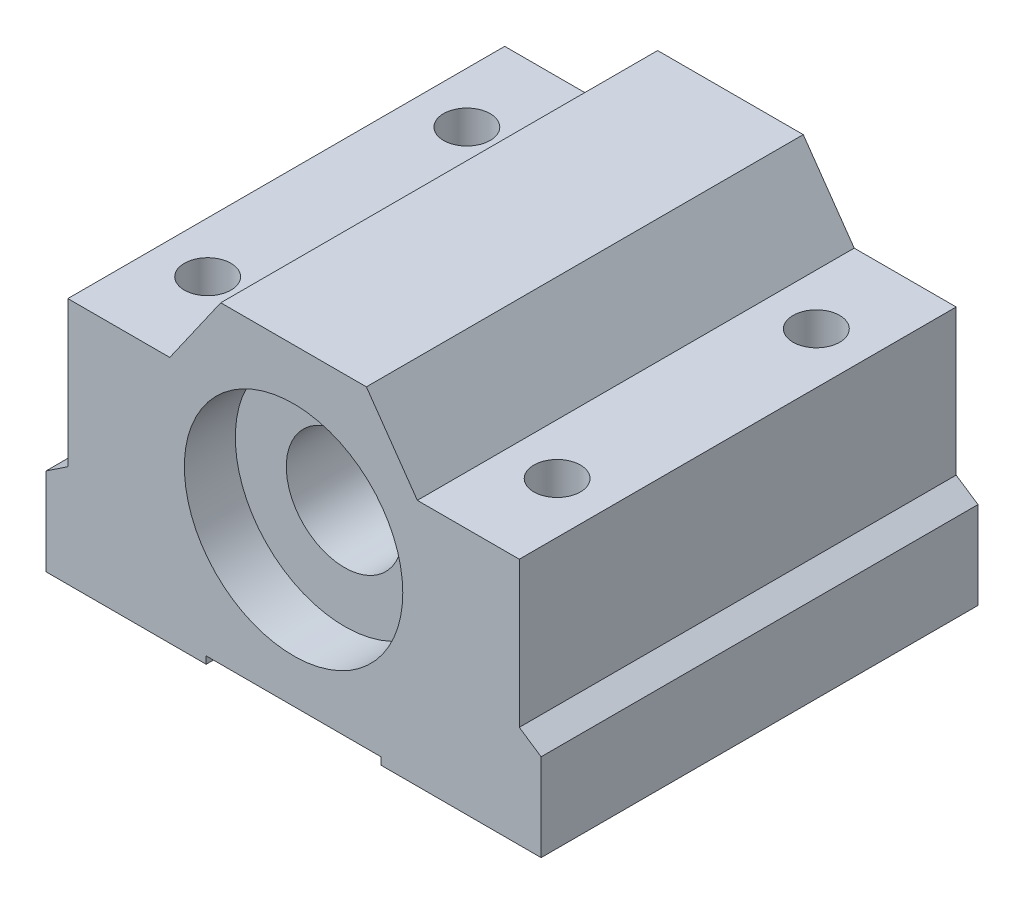
ISO-10303-21;
HEADER;
FILE_DESCRIPTION(('STEP AP214'),'2;1');
FILE_NAME('part.step','',(''),(''),'','','');
FILE_SCHEMA(('AUTOMOTIVE_DESIGN { 1 0 10303 214 1 1 1 1 }'));
ENDSEC;
DATA;
#1=APPLICATION_CONTEXT('core data for automotive mechanical design processes');
#2=APPLICATION_PROTOCOL_DEFINITION('international standard','automotive_design',2000,#1);
#3=PRODUCT_CONTEXT('',#1,'mechanical');
#4=PRODUCT('Part','Part','',(#3));
#5=PRODUCT_RELATED_PRODUCT_CATEGORY('part','',(#4));
#6=PRODUCT_DEFINITION_FORMATION('','',#4);
#7=PRODUCT_DEFINITION_CONTEXT('part definition',#1,'design');
#8=PRODUCT_DEFINITION('design','',#6,#7);
#9=PRODUCT_DEFINITION_SHAPE('','',#8);
#10=(LENGTH_UNIT() NAMED_UNIT(*) SI_UNIT(.MILLI.,.METRE.));
#11=(NAMED_UNIT(*) PLANE_ANGLE_UNIT() SI_UNIT($,.RADIAN.));
#12=(NAMED_UNIT(*) SI_UNIT($,.STERADIAN.) SOLID_ANGLE_UNIT());
#13=UNCERTAINTY_MEASURE_WITH_UNIT(LENGTH_MEASURE(1.E-05),#10,'distance_accuracy_value','');
#14=(GEOMETRIC_REPRESENTATION_CONTEXT(3) GLOBAL_UNCERTAINTY_ASSIGNED_CONTEXT((#13)) GLOBAL_UNIT_ASSIGNED_CONTEXT((#10,
#11,#12)) REPRESENTATION_CONTEXT('',''));
#15=CARTESIAN_POINT('',(0.,0.,0.));
#16=DIRECTION('',(0.,0.,1.));
#17=DIRECTION('',(1.,0.,0.));
#18=AXIS2_PLACEMENT_3D('',#15,#16,#17);
#19=CARTESIAN_POINT('',(0.,0.,-15.));
#20=DIRECTION('',(0.,0.,1.));
#21=DIRECTION('',(1.,0.,0.));
#22=AXIS2_PLACEMENT_3D('',#19,#20,#21);
#23=CYLINDRICAL_SURFACE('',#22,7.5);
#24=CARTESIAN_POINT('',(0.,0.,-15.));
#25=DIRECTION('',(0.,0.,1.));
#26=DIRECTION('',(1.,0.,0.));
#27=AXIS2_PLACEMENT_3D('',#24,#25,#26);
#28=CIRCLE('',#27,7.5);
#29=CARTESIAN_POINT('',(7.5,0.,-15.));
#30=VERTEX_POINT('',#29);
#31=EDGE_CURVE('E166',#30,#30,#28,.T.);
#32=ORIENTED_EDGE('',*,*,#31,.F.);
#33=EDGE_LOOP('',(#32));
#34=FACE_BOUND('',#33,.T.);
#35=CARTESIAN_POINT('',(0.,0.,-11.5));
#36=DIRECTION('',(0.,0.,1.));
#37=DIRECTION('',(1.,0.,0.));
#38=AXIS2_PLACEMENT_3D('',#35,#36,#37);
#39=CIRCLE('',#38,7.5);
#40=CARTESIAN_POINT('',(7.5,0.,-11.5));
#41=VERTEX_POINT('',#40);
#42=EDGE_CURVE('E11',#41,#41,#39,.F.);
#43=ORIENTED_EDGE('',*,*,#42,.F.);
#44=EDGE_LOOP('',(#43));
#45=FACE_BOUND('',#44,.T.);
#46=ADVANCED_FACE('F33',(#34,#45),#23,.F.);
#47=CARTESIAN_POINT('',(5.99999999999999,-11.,-15.));
#48=DIRECTION('',(0.,-1.,0.));
#49=DIRECTION('',(1.,0.,0.));
#50=AXIS2_PLACEMENT_3D('',#47,#48,#49);
#51=PLANE('',#50);
#52=CARTESIAN_POINT('',(12.,-11.,-8.9));
#53=DIRECTION('',(0.,1.,0.));
#54=DIRECTION('',(0.,0.,-1.));
#55=AXIS2_PLACEMENT_3D('',#52,#53,#54);
#56=CIRCLE('',#55,1.6);
#57=CARTESIAN_POINT('',(12.,-11.,-10.5));
#58=VERTEX_POINT('',#57);
#59=EDGE_CURVE('E387',#58,#58,#56,.T.);
#60=ORIENTED_EDGE('',*,*,#59,.T.);
#61=EDGE_LOOP('',(#60));
#62=FACE_BOUND('',#61,.T.);
#63=CARTESIAN_POINT('',(12.,-11.,8.9));
#64=DIRECTION('',(0.,1.,0.));
#65=DIRECTION('',(0.,0.,-1.));
#66=AXIS2_PLACEMENT_3D('',#63,#64,#65);
#67=CIRCLE('',#66,1.6);
#68=CARTESIAN_POINT('',(12.,-11.,7.3));
#69=VERTEX_POINT('',#68);
#70=EDGE_CURVE('E393',#69,#69,#67,.T.);
#71=ORIENTED_EDGE('',*,*,#70,.T.);
#72=EDGE_LOOP('',(#71));
#73=FACE_BOUND('',#72,.T.);
#74=DIRECTION('',(0.,0.,1.));
#75=VECTOR('',#74,1.);
#76=CARTESIAN_POINT('',(17.,-11.,-15.));
#77=LINE('',#76,#75);
#78=CARTESIAN_POINT('',(17.,-11.,-15.));
#79=VERTEX_POINT('',#78);
#80=CARTESIAN_POINT('',(17.,-11.,15.));
#81=VERTEX_POINT('',#80);
#82=EDGE_CURVE('E144',#79,#81,#77,.T.);
#83=ORIENTED_EDGE('',*,*,#82,.T.);
#84=DIRECTION('',(1.,0.,0.));
#85=VECTOR('',#84,1.);
#86=CARTESIAN_POINT('',(5.99999999999999,-11.,15.));
#87=LINE('',#86,#85);
#88=CARTESIAN_POINT('',(5.99999999999999,-11.,15.));
#89=VERTEX_POINT('',#88);
#90=EDGE_CURVE('E147',#89,#81,#87,.T.);
#91=ORIENTED_EDGE('',*,*,#90,.F.);
#92=DIRECTION('',(0.,0.,1.));
#93=VECTOR('',#92,1.);
#94=CARTESIAN_POINT('',(5.99999999999999,-11.,-15.));
#95=LINE('',#94,#93);
#96=CARTESIAN_POINT('',(5.99999999999999,-11.,-15.));
#97=VERTEX_POINT('',#96);
#98=EDGE_CURVE('E41',#97,#89,#95,.T.);
#99=ORIENTED_EDGE('',*,*,#98,.F.);
#100=DIRECTION('',(1.,0.,0.));
#101=VECTOR('',#100,1.);
#102=CARTESIAN_POINT('',(5.99999999999999,-11.,-15.));
#103=LINE('',#102,#101);
#104=EDGE_CURVE('E148',#97,#79,#103,.T.);
#105=ORIENTED_EDGE('',*,*,#104,.T.);
#106=EDGE_LOOP('',(#83,#91,#99,#105));
#107=FACE_BOUND('',#106,.T.);
#108=ADVANCED_FACE('F35',(#62,#73,#107),#51,.T.);
#109=CARTESIAN_POINT('',(5.99999999999999,-10.5,-15.));
#110=DIRECTION('',(-1.,0.,0.));
#111=DIRECTION('',(0.,0.,1.));
#112=AXIS2_PLACEMENT_3D('',#109,#110,#111);
#113=PLANE('',#112);
#114=ORIENTED_EDGE('',*,*,#98,.T.);
#115=DIRECTION('',(0.,-1.,0.));
#116=VECTOR('',#115,1.);
#117=CARTESIAN_POINT('',(5.99999999999999,-10.5,15.));
#118=LINE('',#117,#116);
#119=CARTESIAN_POINT('',(5.99999999999999,-10.5,15.));
#120=VERTEX_POINT('',#119);
#121=EDGE_CURVE('E165',#120,#89,#118,.T.);
#122=ORIENTED_EDGE('',*,*,#121,.F.);
#123=DIRECTION('',(0.,0.,1.));
#124=VECTOR('',#123,1.);
#125=CARTESIAN_POINT('',(5.99999999999999,-10.5,-15.));
#126=LINE('',#125,#124);
#127=CARTESIAN_POINT('',(5.99999999999999,-10.5,-15.));
#128=VERTEX_POINT('',#127);
#129=EDGE_CURVE('E55',#128,#120,#126,.T.);
#130=ORIENTED_EDGE('',*,*,#129,.F.);
#131=DIRECTION('',(0.,-1.,0.));
#132=VECTOR('',#131,1.);
#133=CARTESIAN_POINT('',(5.99999999999999,-10.5,-15.));
#134=LINE('',#133,#132);
#135=EDGE_CURVE('E153',#128,#97,#134,.T.);
#136=ORIENTED_EDGE('',*,*,#135,.T.);
#137=EDGE_LOOP('',(#114,#122,#130,#136));
#138=FACE_BOUND('',#137,.T.);
#139=ADVANCED_FACE('F332',(#138),#113,.T.);
#140=CARTESIAN_POINT('',(-6.,-10.5,-15.));
#141=DIRECTION('',(0.,-1.,0.));
#142=DIRECTION('',(0.,0.,-1.));
#143=AXIS2_PLACEMENT_3D('',#140,#141,#142);
#144=PLANE('',#143);
#145=ORIENTED_EDGE('',*,*,#129,.T.);
#146=DIRECTION('',(1.,0.,0.));
#147=VECTOR('',#146,1.);
#148=CARTESIAN_POINT('',(-6.,-10.5,15.));
#149=LINE('',#148,#147);
#150=CARTESIAN_POINT('',(-6.,-10.5,15.));
#151=VERTEX_POINT('',#150);
#152=EDGE_CURVE('E207',#151,#120,#149,.T.);
#153=ORIENTED_EDGE('',*,*,#152,.F.);
#154=DIRECTION('',(0.,0.,1.));
#155=VECTOR('',#154,1.);
#156=CARTESIAN_POINT('',(-6.,-10.5,-15.));
#157=LINE('',#156,#155);
#158=CARTESIAN_POINT('',(-6.,-10.5,-15.));
#159=VERTEX_POINT('',#158);
#160=EDGE_CURVE('E254',#159,#151,#157,.T.);
#161=ORIENTED_EDGE('',*,*,#160,.F.);
#162=DIRECTION('',(1.,0.,0.));
#163=VECTOR('',#162,1.);
#164=CARTESIAN_POINT('',(-6.,-10.5,-15.));
#165=LINE('',#164,#163);
#166=EDGE_CURVE('E249',#159,#128,#165,.T.);
#167=ORIENTED_EDGE('',*,*,#166,.T.);
#168=EDGE_LOOP('',(#145,#153,#161,#167));
#169=FACE_BOUND('',#168,.T.);
#170=ADVANCED_FACE('F330',(#169),#144,.T.);
#171=CARTESIAN_POINT('',(-6.,-10.5,-15.));
#172=DIRECTION('',(1.,0.,0.));
#173=DIRECTION('',(0.,0.,-1.));
#174=AXIS2_PLACEMENT_3D('',#171,#172,#173);
#175=PLANE('',#174);
#176=ORIENTED_EDGE('',*,*,#160,.T.);
#177=DIRECTION('',(0.,1.,0.));
#178=VECTOR('',#177,1.);
#179=CARTESIAN_POINT('',(-6.,-10.5,15.));
#180=LINE('',#179,#178);
#181=CARTESIAN_POINT('',(-6.,-11.,15.));
#182=VERTEX_POINT('',#181);
#183=EDGE_CURVE('E204',#182,#151,#180,.T.);
#184=ORIENTED_EDGE('',*,*,#183,.F.);
#185=DIRECTION('',(0.,0.,1.));
#186=VECTOR('',#185,1.);
#187=CARTESIAN_POINT('',(-6.,-11.,-15.));
#188=LINE('',#187,#186);
#189=CARTESIAN_POINT('',(-6.,-11.,-15.));
#190=VERTEX_POINT('',#189);
#191=EDGE_CURVE('E256',#190,#182,#188,.T.);
#192=ORIENTED_EDGE('',*,*,#191,.F.);
#193=DIRECTION('',(0.,1.,0.));
#194=VECTOR('',#193,1.);
#195=CARTESIAN_POINT('',(-6.,-10.5,-15.));
#196=LINE('',#195,#194);
#197=EDGE_CURVE('E246',#190,#159,#196,.T.);
#198=ORIENTED_EDGE('',*,*,#197,.T.);
#199=EDGE_LOOP('',(#176,#184,#192,#198));
#200=FACE_BOUND('',#199,.T.);
#201=ADVANCED_FACE('F326',(#200),#175,.T.);
#202=CARTESIAN_POINT('',(-17.,-11.,-15.));
#203=DIRECTION('',(0.,-1.,0.));
#204=DIRECTION('',(1.,0.,0.));
#205=AXIS2_PLACEMENT_3D('',#202,#203,#204);
#206=PLANE('',#205);
#207=CARTESIAN_POINT('',(-12.,-11.,8.9));
#208=DIRECTION('',(0.,1.,0.));
#209=DIRECTION('',(0.,0.,1.));
#210=AXIS2_PLACEMENT_3D('',#207,#208,#209);
#211=CIRCLE('',#210,1.6);
#212=CARTESIAN_POINT('',(-12.,-11.,10.5));
#213=VERTEX_POINT('',#212);
#214=EDGE_CURVE('E381',#213,#213,#211,.T.);
#215=ORIENTED_EDGE('',*,*,#214,.T.);
#216=EDGE_LOOP('',(#215));
#217=FACE_BOUND('',#216,.T.);
#218=CARTESIAN_POINT('',(-12.,-11.,-8.9));
#219=DIRECTION('',(0.,1.,0.));
#220=DIRECTION('',(0.,0.,1.));
#221=AXIS2_PLACEMENT_3D('',#218,#219,#220);
#222=CIRCLE('',#221,1.6);
#223=CARTESIAN_POINT('',(-12.,-11.,-7.3));
#224=VERTEX_POINT('',#223);
#225=EDGE_CURVE('E377',#224,#224,#222,.T.);
#226=ORIENTED_EDGE('',*,*,#225,.T.);
#227=EDGE_LOOP('',(#226));
#228=FACE_BOUND('',#227,.T.);
#229=ORIENTED_EDGE('',*,*,#191,.T.);
#230=DIRECTION('',(1.,0.,0.));
#231=VECTOR('',#230,1.);
#232=CARTESIAN_POINT('',(-17.,-11.,15.));
#233=LINE('',#232,#231);
#234=CARTESIAN_POINT('',(-17.,-11.,15.));
#235=VERTEX_POINT('',#234);
#236=EDGE_CURVE('E201',#235,#182,#233,.T.);
#237=ORIENTED_EDGE('',*,*,#236,.F.);
#238=DIRECTION('',(0.,0.,1.));
#239=VECTOR('',#238,1.);
#240=CARTESIAN_POINT('',(-17.,-11.,-15.));
#241=LINE('',#240,#239);
#242=CARTESIAN_POINT('',(-17.,-11.,-15.));
#243=VERTEX_POINT('',#242);
#244=EDGE_CURVE('E258',#243,#235,#241,.T.);
#245=ORIENTED_EDGE('',*,*,#244,.F.);
#246=DIRECTION('',(1.,0.,0.));
#247=VECTOR('',#246,1.);
#248=CARTESIAN_POINT('',(-17.,-11.,-15.));
#249=LINE('',#248,#247);
#250=EDGE_CURVE('E243',#243,#190,#249,.T.);
#251=ORIENTED_EDGE('',*,*,#250,.T.);
#252=EDGE_LOOP('',(#229,#237,#245,#251));
#253=FACE_BOUND('',#252,.T.);
#254=ADVANCED_FACE('F324',(#217,#228,#253),#206,.T.);
#255=CARTESIAN_POINT('',(-17.,-5.,-15.));
#256=DIRECTION('',(-1.,0.,0.));
#257=DIRECTION('',(0.,0.,1.));
#258=AXIS2_PLACEMENT_3D('',#255,#256,#257);
#259=PLANE('',#258);
#260=ORIENTED_EDGE('',*,*,#244,.T.);
#261=DIRECTION('',(0.,-1.,0.));
#262=VECTOR('',#261,1.);
#263=CARTESIAN_POINT('',(-17.,-5.,15.));
#264=LINE('',#263,#262);
#265=CARTESIAN_POINT('',(-17.,-5.,15.));
#266=VERTEX_POINT('',#265);
#267=EDGE_CURVE('E198',#266,#235,#264,.T.);
#268=ORIENTED_EDGE('',*,*,#267,.F.);
#269=DIRECTION('',(0.,0.,1.));
#270=VECTOR('',#269,1.);
#271=CARTESIAN_POINT('',(-17.,-5.,-15.));
#272=LINE('',#271,#270);
#273=CARTESIAN_POINT('',(-17.,-5.,-15.));
#274=VERTEX_POINT('',#273);
#275=EDGE_CURVE('E260',#274,#266,#272,.T.);
#276=ORIENTED_EDGE('',*,*,#275,.F.);
#277=DIRECTION('',(0.,-1.,0.));
#278=VECTOR('',#277,1.);
#279=CARTESIAN_POINT('',(-17.,-5.,-15.));
#280=LINE('',#279,#278);
#281=EDGE_CURVE('E240',#274,#243,#280,.T.);
#282=ORIENTED_EDGE('',*,*,#281,.T.);
#283=EDGE_LOOP('',(#260,#268,#276,#282));
#284=FACE_BOUND('',#283,.T.);
#285=ADVANCED_FACE('F319',(#284),#259,.T.);
#286=CARTESIAN_POINT('',(-17.,-5.,-15.));
#287=DIRECTION('',(-0.554700196225228,0.832050294337844,0.));
#288=DIRECTION('',(-0.832050294337844,-0.554700196225228,0.));
#289=AXIS2_PLACEMENT_3D('',#286,#287,#288);
#290=PLANE('',#289);
#291=ORIENTED_EDGE('',*,*,#275,.T.);
#292=DIRECTION('',(-0.832050294337844,-0.554700196225228,0.));
#293=VECTOR('',#292,1.);
#294=CARTESIAN_POINT('',(-17.,-5.,15.));
#295=LINE('',#294,#293);
#296=CARTESIAN_POINT('',(-15.5,-4.,15.));
#297=VERTEX_POINT('',#296);
#298=EDGE_CURVE('E195',#297,#266,#295,.T.);
#299=ORIENTED_EDGE('',*,*,#298,.F.);
#300=DIRECTION('',(0.,0.,1.));
#301=VECTOR('',#300,1.);
#302=CARTESIAN_POINT('',(-15.5,-4.,-15.));
#303=LINE('',#302,#301);
#304=CARTESIAN_POINT('',(-15.5,-4.,-15.));
#305=VERTEX_POINT('',#304);
#306=EDGE_CURVE('E262',#305,#297,#303,.T.);
#307=ORIENTED_EDGE('',*,*,#306,.F.);
#308=DIRECTION('',(-0.832050294337844,-0.554700196225228,0.));
#309=VECTOR('',#308,1.);
#310=CARTESIAN_POINT('',(-17.,-5.,-15.));
#311=LINE('',#310,#309);
#312=EDGE_CURVE('E237',#305,#274,#311,.T.);
#313=ORIENTED_EDGE('',*,*,#312,.T.);
#314=EDGE_LOOP('',(#291,#299,#307,#313));
#315=FACE_BOUND('',#314,.T.);
#316=ADVANCED_FACE('F314',(#315),#290,.T.);
#317=CARTESIAN_POINT('',(-15.5,6.,-15.));
#318=DIRECTION('',(-1.,0.,0.));
#319=DIRECTION('',(0.,-1.,0.));
#320=AXIS2_PLACEMENT_3D('',#317,#318,#319);
#321=PLANE('',#320);
#322=ORIENTED_EDGE('',*,*,#306,.T.);
#323=DIRECTION('',(0.,-1.,0.));
#324=VECTOR('',#323,1.);
#325=CARTESIAN_POINT('',(-15.5,6.,15.));
#326=LINE('',#325,#324);
#327=CARTESIAN_POINT('',(-15.5,6.,15.));
#328=VERTEX_POINT('',#327);
#329=EDGE_CURVE('E192',#328,#297,#326,.T.);
#330=ORIENTED_EDGE('',*,*,#329,.F.);
#331=DIRECTION('',(0.,0.,1.));
#332=VECTOR('',#331,1.);
#333=CARTESIAN_POINT('',(-15.5,6.,-15.));
#334=LINE('',#333,#332);
#335=CARTESIAN_POINT('',(-15.5,6.,-15.));
#336=VERTEX_POINT('',#335);
#337=EDGE_CURVE('E264',#336,#328,#334,.T.);
#338=ORIENTED_EDGE('',*,*,#337,.F.);
#339=DIRECTION('',(0.,-1.,0.));
#340=VECTOR('',#339,1.);
#341=CARTESIAN_POINT('',(-15.5,6.,-15.));
#342=LINE('',#341,#340);
#343=EDGE_CURVE('E234',#336,#305,#342,.T.);
#344=ORIENTED_EDGE('',*,*,#343,.T.);
#345=EDGE_LOOP('',(#322,#330,#338,#344));
#346=FACE_BOUND('',#345,.T.);
#347=ADVANCED_FACE('F312',(#346),#321,.T.);
#348=CARTESIAN_POINT('',(-15.5,6.,-15.));
#349=DIRECTION('',(0.,1.,0.));
#350=DIRECTION('',(0.,0.,1.));
#351=AXIS2_PLACEMENT_3D('',#348,#349,#350);
#352=PLANE('',#351);
#353=CARTESIAN_POINT('',(-12.,6.,8.9));
#354=DIRECTION('',(0.,1.,0.));
#355=DIRECTION('',(0.,0.,1.));
#356=AXIS2_PLACEMENT_3D('',#353,#354,#355);
#357=CIRCLE('',#356,1.6);
#358=CARTESIAN_POINT('',(-12.,6.,10.5));
#359=VERTEX_POINT('',#358);
#360=EDGE_CURVE('E396',#359,#359,#357,.T.);
#361=ORIENTED_EDGE('',*,*,#360,.F.);
#362=EDGE_LOOP('',(#361));
#363=FACE_BOUND('',#362,.T.);
#364=CARTESIAN_POINT('',(-12.,6.,-8.9));
#365=DIRECTION('',(0.,1.,0.));
#366=DIRECTION('',(0.,0.,1.));
#367=AXIS2_PLACEMENT_3D('',#364,#365,#366);
#368=CIRCLE('',#367,1.6);
#369=CARTESIAN_POINT('',(-12.,6.,-7.3));
#370=VERTEX_POINT('',#369);
#371=EDGE_CURVE('E378',#370,#370,#368,.T.);
#372=ORIENTED_EDGE('',*,*,#371,.F.);
#373=EDGE_LOOP('',(#372));
#374=FACE_BOUND('',#373,.T.);
#375=ORIENTED_EDGE('',*,*,#337,.T.);
#376=DIRECTION('',(-1.,0.,0.));
#377=VECTOR('',#376,1.);
#378=CARTESIAN_POINT('',(-15.5,6.,15.));
#379=LINE('',#378,#377);
#380=CARTESIAN_POINT('',(-8.50000000000001,6.,15.));
#381=VERTEX_POINT('',#380);
#382=EDGE_CURVE('E189',#381,#328,#379,.T.);
#383=ORIENTED_EDGE('',*,*,#382,.F.);
#384=DIRECTION('',(0.,0.,1.));
#385=VECTOR('',#384,1.);
#386=CARTESIAN_POINT('',(-8.50000000000001,6.,-15.));
#387=LINE('',#386,#385);
#388=CARTESIAN_POINT('',(-8.50000000000001,6.,-15.));
#389=VERTEX_POINT('',#388);
#390=EDGE_CURVE('E266',#389,#381,#387,.T.);
#391=ORIENTED_EDGE('',*,*,#390,.F.);
#392=DIRECTION('',(-1.,0.,0.));
#393=VECTOR('',#392,1.);
#394=CARTESIAN_POINT('',(-15.5,6.,-15.));
#395=LINE('',#394,#393);
#396=EDGE_CURVE('E231',#389,#336,#395,.T.);
#397=ORIENTED_EDGE('',*,*,#396,.T.);
#398=EDGE_LOOP('',(#375,#383,#391,#397));
#399=FACE_BOUND('',#398,.T.);
#400=ADVANCED_FACE('F307',(#363,#374,#399),#352,.T.);
#401=CARTESIAN_POINT('',(-5.,11.,-15.));
#402=DIRECTION('',(-0.81923192051904,0.573462344363329,0.));
#403=DIRECTION('',(-0.573462344363329,-0.81923192051904,0.));
#404=AXIS2_PLACEMENT_3D('',#401,#402,#403);
#405=PLANE('',#404);
#406=ORIENTED_EDGE('',*,*,#390,.T.);
#407=DIRECTION('',(-0.573462344363329,-0.81923192051904,0.));
#408=VECTOR('',#407,1.);
#409=CARTESIAN_POINT('',(-5.,11.,15.));
#410=LINE('',#409,#408);
#411=CARTESIAN_POINT('',(-5.,11.,15.));
#412=VERTEX_POINT('',#411);
#413=EDGE_CURVE('E186',#412,#381,#410,.T.);
#414=ORIENTED_EDGE('',*,*,#413,.F.);
#415=DIRECTION('',(0.,0.,1.));
#416=VECTOR('',#415,1.);
#417=CARTESIAN_POINT('',(-5.,11.,-15.));
#418=LINE('',#417,#416);
#419=CARTESIAN_POINT('',(-5.,11.,-15.));
#420=VERTEX_POINT('',#419);
#421=EDGE_CURVE('E268',#420,#412,#418,.T.);
#422=ORIENTED_EDGE('',*,*,#421,.F.);
#423=DIRECTION('',(-0.573462344363329,-0.81923192051904,0.));
#424=VECTOR('',#423,1.);
#425=CARTESIAN_POINT('',(-5.,11.,-15.));
#426=LINE('',#425,#424);
#427=EDGE_CURVE('E228',#420,#389,#426,.T.);
#428=ORIENTED_EDGE('',*,*,#427,.T.);
#429=EDGE_LOOP('',(#406,#414,#422,#428));
#430=FACE_BOUND('',#429,.T.);
#431=ADVANCED_FACE('F302',(#430),#405,.T.);
#432=CARTESIAN_POINT('',(-5.,11.,-15.));
#433=DIRECTION('',(0.,1.,0.));
#434=DIRECTION('',(0.,0.,1.));
#435=AXIS2_PLACEMENT_3D('',#432,#433,#434);
#436=PLANE('',#435);
#437=ORIENTED_EDGE('',*,*,#421,.T.);
#438=DIRECTION('',(-1.,0.,0.));
#439=VECTOR('',#438,1.);
#440=CARTESIAN_POINT('',(-5.,11.,15.));
#441=LINE('',#440,#439);
#442=CARTESIAN_POINT('',(4.99999999999999,11.,15.));
#443=VERTEX_POINT('',#442);
#444=EDGE_CURVE('E183',#443,#412,#441,.T.);
#445=ORIENTED_EDGE('',*,*,#444,.F.);
#446=DIRECTION('',(0.,0.,1.));
#447=VECTOR('',#446,1.);
#448=CARTESIAN_POINT('',(4.99999999999999,11.,-15.));
#449=LINE('',#448,#447);
#450=CARTESIAN_POINT('',(4.99999999999999,11.,-15.));
#451=VERTEX_POINT('',#450);
#452=EDGE_CURVE('E270',#451,#443,#449,.T.);
#453=ORIENTED_EDGE('',*,*,#452,.F.);
#454=DIRECTION('',(-1.,0.,0.));
#455=VECTOR('',#454,1.);
#456=CARTESIAN_POINT('',(-5.,11.,-15.));
#457=LINE('',#456,#455);
#458=EDGE_CURVE('E225',#451,#420,#457,.T.);
#459=ORIENTED_EDGE('',*,*,#458,.T.);
#460=EDGE_LOOP('',(#437,#445,#453,#459));
#461=FACE_BOUND('',#460,.T.);
#462=ADVANCED_FACE('F300',(#461),#436,.T.);
#463=CARTESIAN_POINT('',(4.99999999999999,11.,-15.));
#464=DIRECTION('',(0.81923192051904,0.573462344363329,0.));
#465=DIRECTION('',(-0.573462344363329,0.81923192051904,0.));
#466=AXIS2_PLACEMENT_3D('',#463,#464,#465);
#467=PLANE('',#466);
#468=ORIENTED_EDGE('',*,*,#452,.T.);
#469=DIRECTION('',(-0.573462344363329,0.81923192051904,0.));
#470=VECTOR('',#469,1.);
#471=CARTESIAN_POINT('',(4.99999999999999,11.,15.));
#472=LINE('',#471,#470);
#473=CARTESIAN_POINT('',(8.5,6.,15.));
#474=VERTEX_POINT('',#473);
#475=EDGE_CURVE('E180',#474,#443,#472,.T.);
#476=ORIENTED_EDGE('',*,*,#475,.F.);
#477=DIRECTION('',(0.,0.,1.));
#478=VECTOR('',#477,1.);
#479=CARTESIAN_POINT('',(8.5,6.,-15.));
#480=LINE('',#479,#478);
#481=CARTESIAN_POINT('',(8.5,6.,-15.));
#482=VERTEX_POINT('',#481);
#483=EDGE_CURVE('E272',#482,#474,#480,.T.);
#484=ORIENTED_EDGE('',*,*,#483,.F.);
#485=DIRECTION('',(-0.573462344363329,0.81923192051904,0.));
#486=VECTOR('',#485,1.);
#487=CARTESIAN_POINT('',(4.99999999999999,11.,-15.));
#488=LINE('',#487,#486);
#489=EDGE_CURVE('E222',#482,#451,#488,.T.);
#490=ORIENTED_EDGE('',*,*,#489,.T.);
#491=EDGE_LOOP('',(#468,#476,#484,#490));
#492=FACE_BOUND('',#491,.T.);
#493=ADVANCED_FACE('F295',(#492),#467,.T.);
#494=CARTESIAN_POINT('',(8.5,6.,-15.));
#495=DIRECTION('',(0.,1.,0.));
#496=DIRECTION('',(0.,0.,1.));
#497=AXIS2_PLACEMENT_3D('',#494,#495,#496);
#498=PLANE('',#497);
#499=CARTESIAN_POINT('',(12.,6.,-8.9));
#500=DIRECTION('',(0.,1.,0.));
#501=DIRECTION('',(0.,0.,-1.));
#502=AXIS2_PLACEMENT_3D('',#499,#500,#501);
#503=CIRCLE('',#502,1.6);
#504=CARTESIAN_POINT('',(12.,6.,-10.5));
#505=VERTEX_POINT('',#504);
#506=EDGE_CURVE('E384',#505,#505,#503,.T.);
#507=ORIENTED_EDGE('',*,*,#506,.F.);
#508=EDGE_LOOP('',(#507));
#509=FACE_BOUND('',#508,.T.);
#510=CARTESIAN_POINT('',(12.,6.,8.9));
#511=DIRECTION('',(0.,1.,0.));
#512=DIRECTION('',(0.,0.,-1.));
#513=AXIS2_PLACEMENT_3D('',#510,#511,#512);
#514=CIRCLE('',#513,1.6);
#515=CARTESIAN_POINT('',(12.,6.,7.3));
#516=VERTEX_POINT('',#515);
#517=EDGE_CURVE('E390',#516,#516,#514,.T.);
#518=ORIENTED_EDGE('',*,*,#517,.F.);
#519=EDGE_LOOP('',(#518));
#520=FACE_BOUND('',#519,.T.);
#521=ORIENTED_EDGE('',*,*,#483,.T.);
#522=DIRECTION('',(-1.,0.,0.));
#523=VECTOR('',#522,1.);
#524=CARTESIAN_POINT('',(8.5,6.,15.));
#525=LINE('',#524,#523);
#526=CARTESIAN_POINT('',(15.5,6.,15.));
#527=VERTEX_POINT('',#526);
#528=EDGE_CURVE('E177',#527,#474,#525,.T.);
#529=ORIENTED_EDGE('',*,*,#528,.F.);
#530=DIRECTION('',(0.,0.,1.));
#531=VECTOR('',#530,1.);
#532=CARTESIAN_POINT('',(15.5,6.,-15.));
#533=LINE('',#532,#531);
#534=CARTESIAN_POINT('',(15.5,6.,-15.));
#535=VERTEX_POINT('',#534);
#536=EDGE_CURVE('E274',#535,#527,#533,.T.);
#537=ORIENTED_EDGE('',*,*,#536,.F.);
#538=DIRECTION('',(-1.,0.,0.));
#539=VECTOR('',#538,1.);
#540=CARTESIAN_POINT('',(8.5,6.,-15.));
#541=LINE('',#540,#539);
#542=EDGE_CURVE('E219',#535,#482,#541,.T.);
#543=ORIENTED_EDGE('',*,*,#542,.T.);
#544=EDGE_LOOP('',(#521,#529,#537,#543));
#545=FACE_BOUND('',#544,.T.);
#546=ADVANCED_FACE('F288',(#509,#520,#545),#498,.T.);
#547=CARTESIAN_POINT('',(15.5,6.,-15.));
#548=DIRECTION('',(1.,0.,0.));
#549=DIRECTION('',(0.,1.,0.));
#550=AXIS2_PLACEMENT_3D('',#547,#548,#549);
#551=PLANE('',#550);
#552=ORIENTED_EDGE('',*,*,#536,.T.);
#553=DIRECTION('',(0.,1.,0.));
#554=VECTOR('',#553,1.);
#555=CARTESIAN_POINT('',(15.5,6.,15.));
#556=LINE('',#555,#554);
#557=CARTESIAN_POINT('',(15.5,-3.99999999999999,15.));
#558=VERTEX_POINT('',#557);
#559=EDGE_CURVE('E174',#558,#527,#556,.T.);
#560=ORIENTED_EDGE('',*,*,#559,.F.);
#561=DIRECTION('',(0.,0.,1.));
#562=VECTOR('',#561,1.);
#563=CARTESIAN_POINT('',(15.5,-3.99999999999999,-15.));
#564=LINE('',#563,#562);
#565=CARTESIAN_POINT('',(15.5,-3.99999999999999,-15.));
#566=VERTEX_POINT('',#565);
#567=EDGE_CURVE('E276',#566,#558,#564,.T.);
#568=ORIENTED_EDGE('',*,*,#567,.F.);
#569=DIRECTION('',(0.,1.,0.));
#570=VECTOR('',#569,1.);
#571=CARTESIAN_POINT('',(15.5,6.,-15.));
#572=LINE('',#571,#570);
#573=EDGE_CURVE('E216',#566,#535,#572,.T.);
#574=ORIENTED_EDGE('',*,*,#573,.T.);
#575=EDGE_LOOP('',(#552,#560,#568,#574));
#576=FACE_BOUND('',#575,.T.);
#577=ADVANCED_FACE('F285',(#576),#551,.T.);
#578=CARTESIAN_POINT('',(17.,-4.99999999999999,-15.));
#579=DIRECTION('',(0.554700196225224,0.832050294337847,0.));
#580=DIRECTION('',(-0.832050294337847,0.554700196225224,0.));
#581=AXIS2_PLACEMENT_3D('',#578,#579,#580);
#582=PLANE('',#581);
#583=ORIENTED_EDGE('',*,*,#567,.T.);
#584=DIRECTION('',(-0.832050294337847,0.554700196225225,0.));
#585=VECTOR('',#584,1.);
#586=CARTESIAN_POINT('',(17.,-4.99999999999999,15.));
#587=LINE('',#586,#585);
#588=CARTESIAN_POINT('',(17.,-4.99999999999999,15.));
#589=VERTEX_POINT('',#588);
#590=EDGE_CURVE('E160',#589,#558,#587,.T.);
#591=ORIENTED_EDGE('',*,*,#590,.F.);
#592=DIRECTION('',(0.,0.,1.));
#593=VECTOR('',#592,1.);
#594=CARTESIAN_POINT('',(17.,-4.99999999999999,-15.));
#595=LINE('',#594,#593);
#596=CARTESIAN_POINT('',(17.,-4.99999999999999,-15.));
#597=VERTEX_POINT('',#596);
#598=EDGE_CURVE('E152',#597,#589,#595,.T.);
#599=ORIENTED_EDGE('',*,*,#598,.F.);
#600=DIRECTION('',(-0.832050294337847,0.554700196225225,0.));
#601=VECTOR('',#600,1.);
#602=CARTESIAN_POINT('',(17.,-4.99999999999999,-15.));
#603=LINE('',#602,#601);
#604=EDGE_CURVE('E213',#597,#566,#603,.T.);
#605=ORIENTED_EDGE('',*,*,#604,.T.);
#606=EDGE_LOOP('',(#583,#591,#599,#605));
#607=FACE_BOUND('',#606,.T.);
#608=ADVANCED_FACE('F279',(#607),#582,.T.);
#609=CARTESIAN_POINT('',(17.,-4.99999999999999,-15.));
#610=DIRECTION('',(1.,0.,0.));
#611=DIRECTION('',(0.,1.,0.));
#612=AXIS2_PLACEMENT_3D('',#609,#610,#611);
#613=PLANE('',#612);
#614=ORIENTED_EDGE('',*,*,#598,.T.);
#615=DIRECTION('',(0.,1.,0.));
#616=VECTOR('',#615,1.);
#617=CARTESIAN_POINT('',(17.,-4.99999999999999,15.));
#618=LINE('',#617,#616);
#619=EDGE_CURVE('E155',#81,#589,#618,.T.);
#620=ORIENTED_EDGE('',*,*,#619,.F.);
#621=ORIENTED_EDGE('',*,*,#82,.F.);
#622=DIRECTION('',(0.,1.,0.));
#623=VECTOR('',#622,1.);
#624=CARTESIAN_POINT('',(17.,-4.99999999999999,-15.));
#625=LINE('',#624,#623);
#626=EDGE_CURVE('E211',#79,#597,#625,.T.);
#627=ORIENTED_EDGE('',*,*,#626,.T.);
#628=EDGE_LOOP('',(#614,#620,#621,#627));
#629=FACE_BOUND('',#628,.T.);
#630=ADVANCED_FACE('F156',(#629),#613,.T.);
#631=CARTESIAN_POINT('',(0.,0.,-15.));
#632=DIRECTION('',(0.,0.,-1.));
#633=DIRECTION('',(-1.,0.,0.));
#634=AXIS2_PLACEMENT_3D('',#631,#632,#633);
#635=PLANE('',#634);
#636=ORIENTED_EDGE('',*,*,#31,.T.);
#637=EDGE_LOOP('',(#636));
#638=FACE_BOUND('',#637,.T.);
#639=ORIENTED_EDGE('',*,*,#104,.F.);
#640=ORIENTED_EDGE('',*,*,#135,.F.);
#641=ORIENTED_EDGE('',*,*,#166,.F.);
#642=ORIENTED_EDGE('',*,*,#197,.F.);
#643=ORIENTED_EDGE('',*,*,#250,.F.);
#644=ORIENTED_EDGE('',*,*,#281,.F.);
#645=ORIENTED_EDGE('',*,*,#312,.F.);
#646=ORIENTED_EDGE('',*,*,#343,.F.);
#647=ORIENTED_EDGE('',*,*,#396,.F.);
#648=ORIENTED_EDGE('',*,*,#427,.F.);
#649=ORIENTED_EDGE('',*,*,#458,.F.);
#650=ORIENTED_EDGE('',*,*,#489,.F.);
#651=ORIENTED_EDGE('',*,*,#542,.F.);
#652=ORIENTED_EDGE('',*,*,#573,.F.);
#653=ORIENTED_EDGE('',*,*,#604,.F.);
#654=ORIENTED_EDGE('',*,*,#626,.F.);
#655=EDGE_LOOP('',(#639,#640,#641,#642,#643,#644,#645,#646,#647,#648,#649,#650,#651,#652,#653,#654));
#656=FACE_BOUND('',#655,.T.);
#657=ADVANCED_FACE('F291',(#638,#656),#635,.T.);
#658=CARTESIAN_POINT('',(0.,0.,15.));
#659=DIRECTION('',(0.,0.,-1.));
#660=DIRECTION('',(-1.,0.,0.));
#661=AXIS2_PLACEMENT_3D('',#658,#659,#660);
#662=PLANE('',#661);
#663=CARTESIAN_POINT('',(0.,0.,15.));
#664=DIRECTION('',(0.,0.,1.));
#665=DIRECTION('',(1.,0.,0.));
#666=AXIS2_PLACEMENT_3D('',#663,#664,#665);
#667=CIRCLE('',#666,7.5);
#668=CARTESIAN_POINT('',(7.5,0.,15.));
#669=VERTEX_POINT('',#668);
#670=EDGE_CURVE('E169',#669,#669,#667,.T.);
#671=ORIENTED_EDGE('',*,*,#670,.F.);
#672=EDGE_LOOP('',(#671));
#673=FACE_BOUND('',#672,.T.);
#674=ORIENTED_EDGE('',*,*,#90,.T.);
#675=ORIENTED_EDGE('',*,*,#619,.T.);
#676=ORIENTED_EDGE('',*,*,#590,.T.);
#677=ORIENTED_EDGE('',*,*,#559,.T.);
#678=ORIENTED_EDGE('',*,*,#528,.T.);
#679=ORIENTED_EDGE('',*,*,#475,.T.);
#680=ORIENTED_EDGE('',*,*,#444,.T.);
#681=ORIENTED_EDGE('',*,*,#413,.T.);
#682=ORIENTED_EDGE('',*,*,#382,.T.);
#683=ORIENTED_EDGE('',*,*,#329,.T.);
#684=ORIENTED_EDGE('',*,*,#298,.T.);
#685=ORIENTED_EDGE('',*,*,#267,.T.);
#686=ORIENTED_EDGE('',*,*,#236,.T.);
#687=ORIENTED_EDGE('',*,*,#183,.T.);
#688=ORIENTED_EDGE('',*,*,#152,.T.);
#689=ORIENTED_EDGE('',*,*,#121,.T.);
#690=EDGE_LOOP('',(#674,#675,#676,#677,#678,#679,#680,#681,#682,#683,#684,#685,#686,#687,#688,#689));
#691=FACE_BOUND('',#690,.T.);
#692=ADVANCED_FACE('F163',(#673,#691),#662,.F.);
#693=CARTESIAN_POINT('',(0.,0.,11.5));
#694=DIRECTION('',(0.,0.,1.));
#695=DIRECTION('',(1.,0.,0.));
#696=AXIS2_PLACEMENT_3D('',#693,#694,#695);
#697=CIRCLE('',#696,7.5);
#698=CARTESIAN_POINT('',(7.5,0.,11.5));
#699=VERTEX_POINT('',#698);
#700=EDGE_CURVE('E365',#699,#699,#697,.T.);
#701=ORIENTED_EDGE('',*,*,#700,.F.);
#702=EDGE_LOOP('',(#701));
#703=FACE_BOUND('',#702,.T.);
#704=ORIENTED_EDGE('',*,*,#670,.T.);
#705=EDGE_LOOP('',(#704));
#706=FACE_BOUND('',#705,.T.);
#707=ADVANCED_FACE('F345',(#703,#706),#23,.F.);
#708=CARTESIAN_POINT('',(0.,0.,-11.5));
#709=DIRECTION('',(0.,0.,1.));
#710=DIRECTION('',(1.,0.,0.));
#711=AXIS2_PLACEMENT_3D('',#708,#709,#710);
#712=PLANE('',#711);
#713=CARTESIAN_POINT('',(0.,0.,-11.5));
#714=DIRECTION('',(0.,0.,1.));
#715=DIRECTION('',(1.,0.,0.));
#716=AXIS2_PLACEMENT_3D('',#713,#714,#715);
#717=CIRCLE('',#716,4.);
#718=CARTESIAN_POINT('',(4.,0.,-11.5));
#719=VERTEX_POINT('',#718);
#720=EDGE_CURVE('E368',#719,#719,#717,.T.);
#721=ORIENTED_EDGE('',*,*,#720,.T.);
#722=EDGE_LOOP('',(#721));
#723=FACE_BOUND('',#722,.T.);
#724=ORIENTED_EDGE('',*,*,#42,.T.);
#725=EDGE_LOOP('',(#724));
#726=FACE_BOUND('',#725,.T.);
#727=ADVANCED_FACE('F353',(#723,#726),#712,.F.);
#728=CARTESIAN_POINT('',(0.,0.,-11.5));
#729=DIRECTION('',(0.,0.,1.));
#730=DIRECTION('',(1.,0.,0.));
#731=AXIS2_PLACEMENT_3D('',#728,#729,#730);
#732=CYLINDRICAL_SURFACE('',#731,4.);
#733=ORIENTED_EDGE('',*,*,#720,.F.);
#734=EDGE_LOOP('',(#733));
#735=FACE_BOUND('',#734,.T.);
#736=CARTESIAN_POINT('',(0.,0.,11.5));
#737=DIRECTION('',(0.,0.,1.));
#738=DIRECTION('',(1.,0.,0.));
#739=AXIS2_PLACEMENT_3D('',#736,#737,#738);
#740=CIRCLE('',#739,4.);
#741=CARTESIAN_POINT('',(4.,0.,11.5));
#742=VERTEX_POINT('',#741);
#743=EDGE_CURVE('E372',#742,#742,#740,.T.);
#744=ORIENTED_EDGE('',*,*,#743,.T.);
#745=EDGE_LOOP('',(#744));
#746=FACE_BOUND('',#745,.T.);
#747=ADVANCED_FACE('F359',(#735,#746),#732,.F.);
#748=CARTESIAN_POINT('',(0.,0.,11.5));
#749=DIRECTION('',(0.,0.,1.));
#750=DIRECTION('',(1.,0.,0.));
#751=AXIS2_PLACEMENT_3D('',#748,#749,#750);
#752=PLANE('',#751);
#753=ORIENTED_EDGE('',*,*,#700,.T.);
#754=EDGE_LOOP('',(#753));
#755=FACE_BOUND('',#754,.T.);
#756=ORIENTED_EDGE('',*,*,#743,.F.);
#757=EDGE_LOOP('',(#756));
#758=FACE_BOUND('',#757,.T.);
#759=ADVANCED_FACE('F429',(#755,#758),#752,.T.);
#760=CARTESIAN_POINT('',(12.,-11.,8.9));
#761=DIRECTION('',(0.,1.,0.));
#762=DIRECTION('',(0.,0.,1.));
#763=AXIS2_PLACEMENT_3D('',#760,#761,#762);
#764=CYLINDRICAL_SURFACE('',#763,1.6);
#765=ORIENTED_EDGE('',*,*,#70,.F.);
#766=EDGE_LOOP('',(#765));
#767=FACE_BOUND('',#766,.T.);
#768=ORIENTED_EDGE('',*,*,#517,.T.);
#769=EDGE_LOOP('',(#768));
#770=FACE_BOUND('',#769,.T.);
#771=ADVANCED_FACE('F423',(#767,#770),#764,.F.);
#772=CARTESIAN_POINT('',(12.,-11.,-8.9));
#773=DIRECTION('',(0.,1.,0.));
#774=DIRECTION('',(0.,0.,1.));
#775=AXIS2_PLACEMENT_3D('',#772,#773,#774);
#776=CYLINDRICAL_SURFACE('',#775,1.6);
#777=ORIENTED_EDGE('',*,*,#59,.F.);
#778=EDGE_LOOP('',(#777));
#779=FACE_BOUND('',#778,.T.);
#780=ORIENTED_EDGE('',*,*,#506,.T.);
#781=EDGE_LOOP('',(#780));
#782=FACE_BOUND('',#781,.T.);
#783=ADVANCED_FACE('F417',(#779,#782),#776,.F.);
#784=CARTESIAN_POINT('',(-12.,-11.,-8.9));
#785=DIRECTION('',(0.,1.,0.));
#786=DIRECTION('',(0.,0.,1.));
#787=AXIS2_PLACEMENT_3D('',#784,#785,#786);
#788=CYLINDRICAL_SURFACE('',#787,1.6);
#789=ORIENTED_EDGE('',*,*,#225,.F.);
#790=EDGE_LOOP('',(#789));
#791=FACE_BOUND('',#790,.T.);
#792=ORIENTED_EDGE('',*,*,#371,.T.);
#793=EDGE_LOOP('',(#792));
#794=FACE_BOUND('',#793,.T.);
#795=ADVANCED_FACE('F407',(#791,#794),#788,.F.);
#796=CARTESIAN_POINT('',(-12.,-11.,8.9));
#797=DIRECTION('',(0.,1.,0.));
#798=DIRECTION('',(0.,0.,1.));
#799=AXIS2_PLACEMENT_3D('',#796,#797,#798);
#800=CYLINDRICAL_SURFACE('',#799,1.6);
#801=ORIENTED_EDGE('',*,*,#214,.F.);
#802=EDGE_LOOP('',(#801));
#803=FACE_BOUND('',#802,.T.);
#804=ORIENTED_EDGE('',*,*,#360,.T.);
#805=EDGE_LOOP('',(#804));
#806=FACE_BOUND('',#805,.T.);
#807=ADVANCED_FACE('F404',(#803,#806),#800,.F.);
#808=CLOSED_SHELL('',(#46,#108,#139,#170,#201,#254,#285,#316,#347,#400,#431,#462,#493,#546,#577,
#608,#630,#657,#692,#707,#727,#747,#759,#771,#783,#795,#807));
#809=MANIFOLD_SOLID_BREP('B2',#808);
#810=ADVANCED_BREP_SHAPE_REPRESENTATION('',(#18,#809),#14);
#811=SHAPE_DEFINITION_REPRESENTATION(#9,#810);
ENDSEC;
END-ISO-10303-21;
